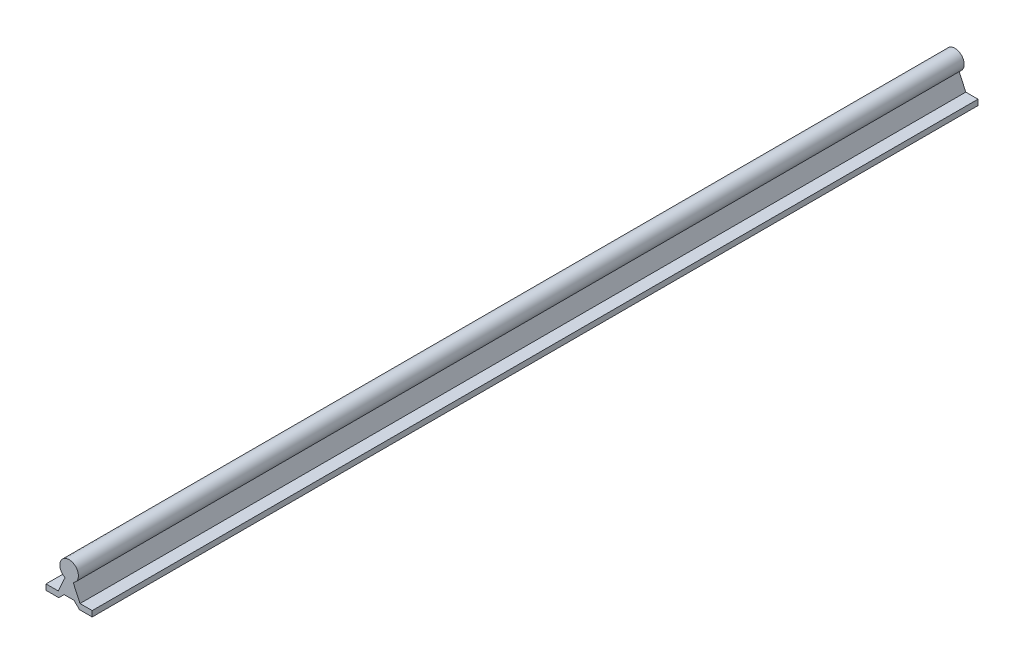
ISO-10303-21;
HEADER;
FILE_DESCRIPTION(('STEP AP214'),'2;1');
FILE_NAME('part.step','',(''),(''),'','','');
FILE_SCHEMA(('AUTOMOTIVE_DESIGN { 1 0 10303 214 1 1 1 1 }'));
ENDSEC;
DATA;
#1=APPLICATION_CONTEXT('core data for automotive mechanical design processes');
#2=APPLICATION_PROTOCOL_DEFINITION('international standard','automotive_design',2000,#1);
#3=PRODUCT_CONTEXT('',#1,'mechanical');
#4=PRODUCT('Part','Part','',(#3));
#5=PRODUCT_RELATED_PRODUCT_CATEGORY('part','',(#4));
#6=PRODUCT_DEFINITION_FORMATION('','',#4);
#7=PRODUCT_DEFINITION_CONTEXT('part definition',#1,'design');
#8=PRODUCT_DEFINITION('design','',#6,#7);
#9=PRODUCT_DEFINITION_SHAPE('','',#8);
#10=(LENGTH_UNIT() NAMED_UNIT(*) SI_UNIT(.MILLI.,.METRE.));
#11=(NAMED_UNIT(*) PLANE_ANGLE_UNIT() SI_UNIT($,.RADIAN.));
#12=(NAMED_UNIT(*) SI_UNIT($,.STERADIAN.) SOLID_ANGLE_UNIT());
#13=UNCERTAINTY_MEASURE_WITH_UNIT(LENGTH_MEASURE(1.E-05),#10,'distance_accuracy_value','');
#14=(GEOMETRIC_REPRESENTATION_CONTEXT(3) GLOBAL_UNCERTAINTY_ASSIGNED_CONTEXT((#13)) GLOBAL_UNIT_ASSIGNED_CONTEXT((#10,
#11,#12)) REPRESENTATION_CONTEXT('',''));
#15=CARTESIAN_POINT('',(0.,0.,0.));
#16=DIRECTION('',(0.,0.,1.));
#17=DIRECTION('',(1.,0.,0.));
#18=AXIS2_PLACEMENT_3D('',#15,#16,#17);
#19=CARTESIAN_POINT('',(9.5641655714519,4.38765921480913,762.));
#20=DIRECTION('',(0.908917784747808,0.416975371657772,0.));
#21=DIRECTION('',(-0.416975371657772,0.908917784747808,0.));
#22=AXIS2_PLACEMENT_3D('',#19,#20,#21);
#23=PLANE('',#22);
#24=DIRECTION('',(0.416975371657772,-0.908917784747808,0.));
#25=VECTOR('',#24,1.);
#26=CARTESIAN_POINT('',(9.5641655714519,4.38765921480913,0.));
#27=LINE('',#26,#25);
#28=CARTESIAN_POINT('',(3.5,17.6062527150309,0.));
#29=VERTEX_POINT('',#28);
#30=CARTESIAN_POINT('',(9.375,4.79999999999999,0.));
#31=VERTEX_POINT('',#30);
#32=EDGE_CURVE('E155',#29,#31,#27,.T.);
#33=ORIENTED_EDGE('',*,*,#32,.F.);
#34=DIRECTION('',(0.,0.,-1.));
#35=VECTOR('',#34,1.);
#36=CARTESIAN_POINT('',(3.5,17.6062527150309,762.));
#37=LINE('',#36,#35);
#38=CARTESIAN_POINT('',(3.5,17.6062527150309,762.));
#39=VERTEX_POINT('',#38);
#40=EDGE_CURVE('E11',#39,#29,#37,.T.);
#41=ORIENTED_EDGE('',*,*,#40,.F.);
#42=DIRECTION('',(0.416975371657772,-0.908917784747808,0.));
#43=VECTOR('',#42,1.);
#44=CARTESIAN_POINT('',(9.5641655714519,4.38765921480913,762.));
#45=LINE('',#44,#43);
#46=CARTESIAN_POINT('',(9.375,4.79999999999999,762.));
#47=VERTEX_POINT('',#46);
#48=EDGE_CURVE('E181',#39,#47,#45,.T.);
#49=ORIENTED_EDGE('',*,*,#48,.T.);
#50=DIRECTION('',(0.,0.,-1.));
#51=VECTOR('',#50,1.);
#52=CARTESIAN_POINT('',(9.375,4.79999999999999,762.));
#53=LINE('',#52,#51);
#54=EDGE_CURVE('E100',#47,#31,#53,.T.);
#55=ORIENTED_EDGE('',*,*,#54,.T.);
#56=EDGE_LOOP('',(#33,#41,#49,#55));
#57=FACE_BOUND('',#56,.T.);
#58=ADVANCED_FACE('F38',(#57),#23,.T.);
#59=CARTESIAN_POINT('',(0.,24.8,762.));
#60=DIRECTION('',(0.,0.,-1.));
#61=DIRECTION('',(-1.,0.,0.));
#62=AXIS2_PLACEMENT_3D('',#59,#60,#61);
#63=CYLINDRICAL_SURFACE('',#62,8.);
#64=CARTESIAN_POINT('',(0.,24.8,0.));
#65=DIRECTION('',(0.,0.,1.));
#66=DIRECTION('',(1.,0.,0.));
#67=AXIS2_PLACEMENT_3D('',#64,#65,#66);
#68=CIRCLE('',#67,8.);
#69=CARTESIAN_POINT('',(-3.5,17.6062527150309,0.));
#70=VERTEX_POINT('',#69);
#71=EDGE_CURVE('E158',#29,#70,#68,.T.);
#72=ORIENTED_EDGE('',*,*,#71,.T.);
#73=DIRECTION('',(0.,0.,-1.));
#74=VECTOR('',#73,1.);
#75=CARTESIAN_POINT('',(-3.5,17.6062527150309,762.));
#76=LINE('',#75,#74);
#77=CARTESIAN_POINT('',(-3.5,17.6062527150309,762.));
#78=VERTEX_POINT('',#77);
#79=EDGE_CURVE('E46',#78,#70,#76,.T.);
#80=ORIENTED_EDGE('',*,*,#79,.F.);
#81=CARTESIAN_POINT('',(0.,24.8,762.));
#82=DIRECTION('',(0.,0.,1.));
#83=DIRECTION('',(1.,0.,0.));
#84=AXIS2_PLACEMENT_3D('',#81,#82,#83);
#85=CIRCLE('',#84,8.);
#86=EDGE_CURVE('E242',#39,#78,#85,.T.);
#87=ORIENTED_EDGE('',*,*,#86,.F.);
#88=ORIENTED_EDGE('',*,*,#40,.T.);
#89=EDGE_LOOP('',(#72,#80,#87,#88));
#90=FACE_BOUND('',#89,.T.);
#91=ADVANCED_FACE('F245',(#90),#63,.T.);
#92=CARTESIAN_POINT('',(-9.5641655714519,4.38765921480913,762.));
#93=DIRECTION('',(0.908917784747808,-0.416975371657772,0.));
#94=DIRECTION('',(0.416975371657772,0.908917784747808,0.));
#95=AXIS2_PLACEMENT_3D('',#92,#93,#94);
#96=PLANE('',#95);
#97=DIRECTION('',(-0.416975371657772,-0.908917784747808,0.));
#98=VECTOR('',#97,1.);
#99=CARTESIAN_POINT('',(-9.5641655714519,4.38765921480913,0.));
#100=LINE('',#99,#98);
#101=CARTESIAN_POINT('',(-9.375,4.79999999999999,0.));
#102=VERTEX_POINT('',#101);
#103=EDGE_CURVE('E160',#70,#102,#100,.T.);
#104=ORIENTED_EDGE('',*,*,#103,.T.);
#105=DIRECTION('',(0.,0.,-1.));
#106=VECTOR('',#105,1.);
#107=CARTESIAN_POINT('',(-9.375,4.79999999999999,762.));
#108=LINE('',#107,#106);
#109=CARTESIAN_POINT('',(-9.375,4.79999999999999,762.));
#110=VERTEX_POINT('',#109);
#111=EDGE_CURVE('E199',#110,#102,#108,.T.);
#112=ORIENTED_EDGE('',*,*,#111,.F.);
#113=DIRECTION('',(-0.416975371657772,-0.908917784747808,0.));
#114=VECTOR('',#113,1.);
#115=CARTESIAN_POINT('',(-9.5641655714519,4.38765921480913,762.));
#116=LINE('',#115,#114);
#117=EDGE_CURVE('E208',#78,#110,#116,.T.);
#118=ORIENTED_EDGE('',*,*,#117,.F.);
#119=ORIENTED_EDGE('',*,*,#79,.T.);
#120=EDGE_LOOP('',(#104,#112,#118,#119));
#121=FACE_BOUND('',#120,.T.);
#122=ADVANCED_FACE('F206',(#121),#96,.F.);
#123=CARTESIAN_POINT('',(0.,4.79999999999999,762.));
#124=DIRECTION('',(0.,-1.,0.));
#125=DIRECTION('',(1.,0.,0.));
#126=AXIS2_PLACEMENT_3D('',#123,#124,#125);
#127=PLANE('',#126);
#128=DIRECTION('',(-1.,0.,0.));
#129=VECTOR('',#128,1.);
#130=CARTESIAN_POINT('',(0.,4.79999999999999,0.));
#131=LINE('',#130,#129);
#132=CARTESIAN_POINT('',(-19.875,4.79999999999999,0.));
#133=VERTEX_POINT('',#132);
#134=EDGE_CURVE('E162',#102,#133,#131,.T.);
#135=ORIENTED_EDGE('',*,*,#134,.T.);
#136=DIRECTION('',(0.,0.,-1.));
#137=VECTOR('',#136,1.);
#138=CARTESIAN_POINT('',(-19.875,4.79999999999999,762.));
#139=LINE('',#138,#137);
#140=CARTESIAN_POINT('',(-19.875,4.79999999999999,762.));
#141=VERTEX_POINT('',#140);
#142=EDGE_CURVE('E196',#141,#133,#139,.T.);
#143=ORIENTED_EDGE('',*,*,#142,.F.);
#144=DIRECTION('',(-1.,0.,0.));
#145=VECTOR('',#144,1.);
#146=CARTESIAN_POINT('',(0.,4.79999999999999,762.));
#147=LINE('',#146,#145);
#148=EDGE_CURVE('E227',#110,#141,#147,.T.);
#149=ORIENTED_EDGE('',*,*,#148,.F.);
#150=ORIENTED_EDGE('',*,*,#111,.T.);
#151=EDGE_LOOP('',(#135,#143,#149,#150));
#152=FACE_BOUND('',#151,.T.);
#153=ADVANCED_FACE('F218',(#152),#127,.F.);
#154=CARTESIAN_POINT('',(-19.875,0.,762.));
#155=DIRECTION('',(1.,0.,0.));
#156=DIRECTION('',(0.,0.,-1.));
#157=AXIS2_PLACEMENT_3D('',#154,#155,#156);
#158=PLANE('',#157);
#159=DIRECTION('',(0.,-1.,0.));
#160=VECTOR('',#159,1.);
#161=CARTESIAN_POINT('',(-19.875,0.,0.));
#162=LINE('',#161,#160);
#163=CARTESIAN_POINT('',(-19.875,0.,0.));
#164=VERTEX_POINT('',#163);
#165=EDGE_CURVE('E164',#133,#164,#162,.T.);
#166=ORIENTED_EDGE('',*,*,#165,.T.);
#167=DIRECTION('',(0.,0.,-1.));
#168=VECTOR('',#167,1.);
#169=CARTESIAN_POINT('',(-19.875,0.,762.));
#170=LINE('',#169,#168);
#171=CARTESIAN_POINT('',(-19.875,0.,762.));
#172=VERTEX_POINT('',#171);
#173=EDGE_CURVE('E193',#172,#164,#170,.T.);
#174=ORIENTED_EDGE('',*,*,#173,.F.);
#175=DIRECTION('',(0.,-1.,0.));
#176=VECTOR('',#175,1.);
#177=CARTESIAN_POINT('',(-19.875,0.,762.));
#178=LINE('',#177,#176);
#179=EDGE_CURVE('E224',#141,#172,#178,.T.);
#180=ORIENTED_EDGE('',*,*,#179,.F.);
#181=ORIENTED_EDGE('',*,*,#142,.T.);
#182=EDGE_LOOP('',(#166,#174,#180,#181));
#183=FACE_BOUND('',#182,.T.);
#184=ADVANCED_FACE('F222',(#183),#158,.F.);
#185=CARTESIAN_POINT('',(0.,0.,762.));
#186=DIRECTION('',(0.,1.,0.));
#187=DIRECTION('',(-1.,0.,0.));
#188=AXIS2_PLACEMENT_3D('',#185,#186,#187);
#189=PLANE('',#188);
#190=DIRECTION('',(1.,0.,0.));
#191=VECTOR('',#190,1.);
#192=CARTESIAN_POINT('',(0.,0.,0.));
#193=LINE('',#192,#191);
#194=CARTESIAN_POINT('',(-8.875,0.,0.));
#195=VERTEX_POINT('',#194);
#196=EDGE_CURVE('E166',#164,#195,#193,.T.);
#197=ORIENTED_EDGE('',*,*,#196,.T.);
#198=DIRECTION('',(0.,0.,-1.));
#199=VECTOR('',#198,1.);
#200=CARTESIAN_POINT('',(-8.875,0.,762.));
#201=LINE('',#200,#199);
#202=CARTESIAN_POINT('',(-8.875,0.,762.));
#203=VERTEX_POINT('',#202);
#204=EDGE_CURVE('E190',#203,#195,#201,.T.);
#205=ORIENTED_EDGE('',*,*,#204,.F.);
#206=DIRECTION('',(1.,0.,0.));
#207=VECTOR('',#206,1.);
#208=CARTESIAN_POINT('',(0.,0.,762.));
#209=LINE('',#208,#207);
#210=EDGE_CURVE('E226',#172,#203,#209,.T.);
#211=ORIENTED_EDGE('',*,*,#210,.F.);
#212=ORIENTED_EDGE('',*,*,#173,.T.);
#213=EDGE_LOOP('',(#197,#205,#211,#212));
#214=FACE_BOUND('',#213,.T.);
#215=ADVANCED_FACE('F257',(#214),#189,.F.);
#216=CARTESIAN_POINT('',(-4.43750000000002,4.4375,762.));
#217=DIRECTION('',(-0.707106781186549,0.707106781186546,0.));
#218=DIRECTION('',(-0.707106781186546,-0.707106781186549,0.));
#219=AXIS2_PLACEMENT_3D('',#216,#217,#218);
#220=PLANE('',#219);
#221=DIRECTION('',(0.707106781186546,0.707106781186549,0.));
#222=VECTOR('',#221,1.);
#223=CARTESIAN_POINT('',(-4.43750000000002,4.4375,0.));
#224=LINE('',#223,#222);
#225=CARTESIAN_POINT('',(-4.27500000000002,4.59999999999999,0.));
#226=VERTEX_POINT('',#225);
#227=EDGE_CURVE('E168',#195,#226,#224,.T.);
#228=ORIENTED_EDGE('',*,*,#227,.T.);
#229=DIRECTION('',(0.,0.,-1.));
#230=VECTOR('',#229,1.);
#231=CARTESIAN_POINT('',(-4.27500000000002,4.59999999999999,762.));
#232=LINE('',#231,#230);
#233=CARTESIAN_POINT('',(-4.27500000000002,4.59999999999999,762.));
#234=VERTEX_POINT('',#233);
#235=EDGE_CURVE('E187',#234,#226,#232,.T.);
#236=ORIENTED_EDGE('',*,*,#235,.F.);
#237=DIRECTION('',(0.707106781186546,0.707106781186549,0.));
#238=VECTOR('',#237,1.);
#239=CARTESIAN_POINT('',(-4.43750000000002,4.4375,762.));
#240=LINE('',#239,#238);
#241=EDGE_CURVE('E229',#203,#234,#240,.T.);
#242=ORIENTED_EDGE('',*,*,#241,.F.);
#243=ORIENTED_EDGE('',*,*,#204,.T.);
#244=EDGE_LOOP('',(#228,#236,#242,#243));
#245=FACE_BOUND('',#244,.T.);
#246=ADVANCED_FACE('F260',(#245),#220,.F.);
#247=CARTESIAN_POINT('',(0.,4.6,762.));
#248=DIRECTION('',(0.,1.,0.));
#249=DIRECTION('',(-1.,0.,0.));
#250=AXIS2_PLACEMENT_3D('',#247,#248,#249);
#251=PLANE('',#250);
#252=DIRECTION('',(1.,0.,0.));
#253=VECTOR('',#252,1.);
#254=CARTESIAN_POINT('',(0.,4.6,0.));
#255=LINE('',#254,#253);
#256=CARTESIAN_POINT('',(4.27500000000002,4.6,0.));
#257=VERTEX_POINT('',#256);
#258=EDGE_CURVE('E170',#226,#257,#255,.T.);
#259=ORIENTED_EDGE('',*,*,#258,.T.);
#260=DIRECTION('',(0.,0.,-1.));
#261=VECTOR('',#260,1.);
#262=CARTESIAN_POINT('',(4.27500000000002,4.6,762.));
#263=LINE('',#262,#261);
#264=CARTESIAN_POINT('',(4.27500000000002,4.6,762.));
#265=VERTEX_POINT('',#264);
#266=EDGE_CURVE('E185',#265,#257,#263,.T.);
#267=ORIENTED_EDGE('',*,*,#266,.F.);
#268=DIRECTION('',(1.,0.,0.));
#269=VECTOR('',#268,1.);
#270=CARTESIAN_POINT('',(0.,4.6,762.));
#271=LINE('',#270,#269);
#272=EDGE_CURVE('E235',#234,#265,#271,.T.);
#273=ORIENTED_EDGE('',*,*,#272,.F.);
#274=ORIENTED_EDGE('',*,*,#235,.T.);
#275=EDGE_LOOP('',(#259,#267,#273,#274));
#276=FACE_BOUND('',#275,.T.);
#277=ADVANCED_FACE('F264',(#276),#251,.F.);
#278=CARTESIAN_POINT('',(4.43750000000001,4.4375,762.));
#279=DIRECTION('',(-0.707106781186549,-0.707106781186546,0.));
#280=DIRECTION('',(0.707106781186546,-0.707106781186549,0.));
#281=AXIS2_PLACEMENT_3D('',#278,#279,#280);
#282=PLANE('',#281);
#283=DIRECTION('',(-0.707106781186546,0.707106781186549,0.));
#284=VECTOR('',#283,1.);
#285=CARTESIAN_POINT('',(4.43750000000001,4.4375,0.));
#286=LINE('',#285,#284);
#287=CARTESIAN_POINT('',(8.875,0.,0.));
#288=VERTEX_POINT('',#287);
#289=EDGE_CURVE('E173',#288,#257,#286,.T.);
#290=ORIENTED_EDGE('',*,*,#289,.F.);
#291=DIRECTION('',(0.,0.,-1.));
#292=VECTOR('',#291,1.);
#293=CARTESIAN_POINT('',(8.875,0.,762.));
#294=LINE('',#293,#292);
#295=CARTESIAN_POINT('',(8.875,0.,762.));
#296=VERTEX_POINT('',#295);
#297=EDGE_CURVE('E142',#296,#288,#294,.T.);
#298=ORIENTED_EDGE('',*,*,#297,.F.);
#299=DIRECTION('',(-0.707106781186546,0.707106781186549,0.));
#300=VECTOR('',#299,1.);
#301=CARTESIAN_POINT('',(4.43750000000001,4.4375,762.));
#302=LINE('',#301,#300);
#303=EDGE_CURVE('E148',#296,#265,#302,.T.);
#304=ORIENTED_EDGE('',*,*,#303,.T.);
#305=ORIENTED_EDGE('',*,*,#266,.T.);
#306=EDGE_LOOP('',(#290,#298,#304,#305));
#307=FACE_BOUND('',#306,.T.);
#308=ADVANCED_FACE('F238',(#307),#282,.T.);
#309=CARTESIAN_POINT('',(0.,0.,762.));
#310=DIRECTION('',(0.,-1.,0.));
#311=DIRECTION('',(1.,0.,0.));
#312=AXIS2_PLACEMENT_3D('',#309,#310,#311);
#313=PLANE('',#312);
#314=DIRECTION('',(-1.,0.,0.));
#315=VECTOR('',#314,1.);
#316=CARTESIAN_POINT('',(0.,0.,0.));
#317=LINE('',#316,#315);
#318=CARTESIAN_POINT('',(19.875,0.,0.));
#319=VERTEX_POINT('',#318);
#320=EDGE_CURVE('E137',#319,#288,#317,.T.);
#321=ORIENTED_EDGE('',*,*,#320,.F.);
#322=DIRECTION('',(0.,0.,-1.));
#323=VECTOR('',#322,1.);
#324=CARTESIAN_POINT('',(19.875,0.,762.));
#325=LINE('',#324,#323);
#326=CARTESIAN_POINT('',(19.875,0.,762.));
#327=VERTEX_POINT('',#326);
#328=EDGE_CURVE('E132',#327,#319,#325,.T.);
#329=ORIENTED_EDGE('',*,*,#328,.F.);
#330=DIRECTION('',(-1.,0.,0.));
#331=VECTOR('',#330,1.);
#332=CARTESIAN_POINT('',(0.,0.,762.));
#333=LINE('',#332,#331);
#334=EDGE_CURVE('E135',#327,#296,#333,.T.);
#335=ORIENTED_EDGE('',*,*,#334,.T.);
#336=ORIENTED_EDGE('',*,*,#297,.T.);
#337=EDGE_LOOP('',(#321,#329,#335,#336));
#338=FACE_BOUND('',#337,.T.);
#339=ADVANCED_FACE('F134',(#338),#313,.T.);
#340=CARTESIAN_POINT('',(19.875,0.,762.));
#341=DIRECTION('',(1.,0.,0.));
#342=DIRECTION('',(0.,0.,-1.));
#343=AXIS2_PLACEMENT_3D('',#340,#341,#342);
#344=PLANE('',#343);
#345=DIRECTION('',(0.,-1.,0.));
#346=VECTOR('',#345,1.);
#347=CARTESIAN_POINT('',(19.875,0.,0.));
#348=LINE('',#347,#346);
#349=CARTESIAN_POINT('',(19.875,4.79999999999999,0.));
#350=VERTEX_POINT('',#349);
#351=EDGE_CURVE('E177',#350,#319,#348,.T.);
#352=ORIENTED_EDGE('',*,*,#351,.F.);
#353=DIRECTION('',(0.,0.,-1.));
#354=VECTOR('',#353,1.);
#355=CARTESIAN_POINT('',(19.875,4.79999999999999,762.));
#356=LINE('',#355,#354);
#357=CARTESIAN_POINT('',(19.875,4.79999999999999,762.));
#358=VERTEX_POINT('',#357);
#359=EDGE_CURVE('E93',#358,#350,#356,.T.);
#360=ORIENTED_EDGE('',*,*,#359,.F.);
#361=DIRECTION('',(0.,-1.,0.));
#362=VECTOR('',#361,1.);
#363=CARTESIAN_POINT('',(19.875,0.,762.));
#364=LINE('',#363,#362);
#365=EDGE_CURVE('E146',#358,#327,#364,.T.);
#366=ORIENTED_EDGE('',*,*,#365,.T.);
#367=ORIENTED_EDGE('',*,*,#328,.T.);
#368=EDGE_LOOP('',(#352,#360,#366,#367));
#369=FACE_BOUND('',#368,.T.);
#370=ADVANCED_FACE('F150',(#369),#344,.T.);
#371=CARTESIAN_POINT('',(0.,4.79999999999999,762.));
#372=DIRECTION('',(0.,-1.,0.));
#373=DIRECTION('',(1.,0.,0.));
#374=AXIS2_PLACEMENT_3D('',#371,#372,#373);
#375=PLANE('',#374);
#376=DIRECTION('',(-1.,0.,0.));
#377=VECTOR('',#376,1.);
#378=CARTESIAN_POINT('',(0.,4.79999999999999,0.));
#379=LINE('',#378,#377);
#380=EDGE_CURVE('E179',#350,#31,#379,.T.);
#381=ORIENTED_EDGE('',*,*,#380,.T.);
#382=ORIENTED_EDGE('',*,*,#54,.F.);
#383=DIRECTION('',(-1.,0.,0.));
#384=VECTOR('',#383,1.);
#385=CARTESIAN_POINT('',(0.,4.79999999999999,762.));
#386=LINE('',#385,#384);
#387=EDGE_CURVE('E54',#358,#47,#386,.T.);
#388=ORIENTED_EDGE('',*,*,#387,.F.);
#389=ORIENTED_EDGE('',*,*,#359,.T.);
#390=EDGE_LOOP('',(#381,#382,#388,#389));
#391=FACE_BOUND('',#390,.T.);
#392=ADVANCED_FACE('F241',(#391),#375,.F.);
#393=CARTESIAN_POINT('',(0.,0.,762.));
#394=DIRECTION('',(0.,0.,1.));
#395=DIRECTION('',(1.,0.,0.));
#396=AXIS2_PLACEMENT_3D('',#393,#394,#395);
#397=PLANE('',#396);
#398=ORIENTED_EDGE('',*,*,#48,.F.);
#399=ORIENTED_EDGE('',*,*,#86,.T.);
#400=ORIENTED_EDGE('',*,*,#117,.T.);
#401=ORIENTED_EDGE('',*,*,#148,.T.);
#402=ORIENTED_EDGE('',*,*,#179,.T.);
#403=ORIENTED_EDGE('',*,*,#210,.T.);
#404=ORIENTED_EDGE('',*,*,#241,.T.);
#405=ORIENTED_EDGE('',*,*,#272,.T.);
#406=ORIENTED_EDGE('',*,*,#303,.F.);
#407=ORIENTED_EDGE('',*,*,#334,.F.);
#408=ORIENTED_EDGE('',*,*,#365,.F.);
#409=ORIENTED_EDGE('',*,*,#387,.T.);
#410=EDGE_LOOP('',(#398,#399,#400,#401,#402,#403,#404,#405,#406,#407,#408,#409));
#411=FACE_BOUND('',#410,.T.);
#412=ADVANCED_FACE('F145',(#411),#397,.T.);
#413=CARTESIAN_POINT('',(0.,0.,0.));
#414=DIRECTION('',(0.,0.,1.));
#415=DIRECTION('',(1.,0.,0.));
#416=AXIS2_PLACEMENT_3D('',#413,#414,#415);
#417=PLANE('',#416);
#418=ORIENTED_EDGE('',*,*,#32,.T.);
#419=ORIENTED_EDGE('',*,*,#380,.F.);
#420=ORIENTED_EDGE('',*,*,#351,.T.);
#421=ORIENTED_EDGE('',*,*,#320,.T.);
#422=ORIENTED_EDGE('',*,*,#289,.T.);
#423=ORIENTED_EDGE('',*,*,#258,.F.);
#424=ORIENTED_EDGE('',*,*,#227,.F.);
#425=ORIENTED_EDGE('',*,*,#196,.F.);
#426=ORIENTED_EDGE('',*,*,#165,.F.);
#427=ORIENTED_EDGE('',*,*,#134,.F.);
#428=ORIENTED_EDGE('',*,*,#103,.F.);
#429=ORIENTED_EDGE('',*,*,#71,.F.);
#430=EDGE_LOOP('',(#418,#419,#420,#421,#422,#423,#424,#425,#426,#427,#428,#429));
#431=FACE_BOUND('',#430,.T.);
#432=ADVANCED_FACE('F213',(#431),#417,.F.);
#433=CLOSED_SHELL('',(#58,#91,#122,#153,#184,#215,#246,#277,#308,#339,#370,#392,#412,#432));
#434=MANIFOLD_SOLID_BREP('B2',#433);
#435=ADVANCED_BREP_SHAPE_REPRESENTATION('',(#18,#434),#14);
#436=SHAPE_DEFINITION_REPRESENTATION(#9,#435);
ENDSEC;
END-ISO-10303-21;
